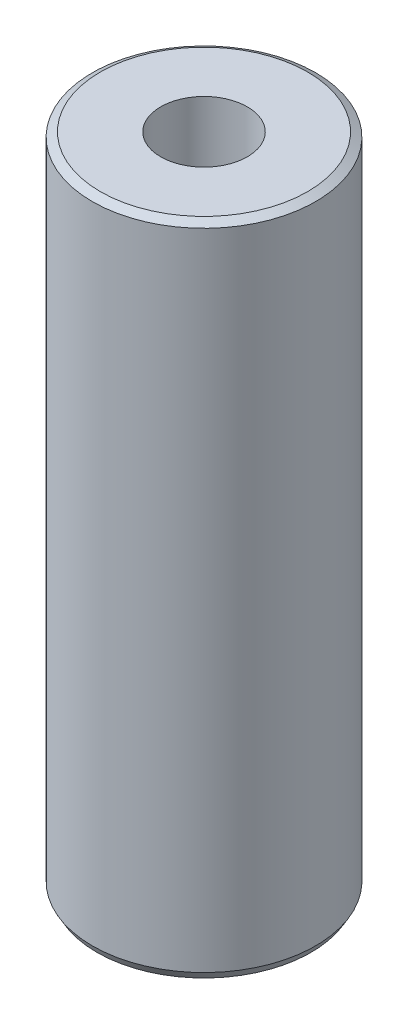
ISO-10303-21;
HEADER;
FILE_DESCRIPTION(('STEP AP214'),'2;1');
FILE_NAME('part.step','',(''),(''),'','','');
FILE_SCHEMA(('AUTOMOTIVE_DESIGN { 1 0 10303 214 1 1 1 1 }'));
ENDSEC;
DATA;
#1=APPLICATION_CONTEXT('core data for automotive mechanical design processes');
#2=APPLICATION_PROTOCOL_DEFINITION('international standard','automotive_design',2000,#1);
#3=PRODUCT_CONTEXT('',#1,'mechanical');
#4=PRODUCT('Part','Part','',(#3));
#5=PRODUCT_RELATED_PRODUCT_CATEGORY('part','',(#4));
#6=PRODUCT_DEFINITION_FORMATION('','',#4);
#7=PRODUCT_DEFINITION_CONTEXT('part definition',#1,'design');
#8=PRODUCT_DEFINITION('design','',#6,#7);
#9=PRODUCT_DEFINITION_SHAPE('','',#8);
#10=(LENGTH_UNIT() NAMED_UNIT(*) SI_UNIT(.MILLI.,.METRE.));
#11=(NAMED_UNIT(*) PLANE_ANGLE_UNIT() SI_UNIT($,.RADIAN.));
#12=(NAMED_UNIT(*) SI_UNIT($,.STERADIAN.) SOLID_ANGLE_UNIT());
#13=UNCERTAINTY_MEASURE_WITH_UNIT(LENGTH_MEASURE(1.E-05),#10,'distance_accuracy_value','');
#14=(GEOMETRIC_REPRESENTATION_CONTEXT(3) GLOBAL_UNCERTAINTY_ASSIGNED_CONTEXT((#13)) GLOBAL_UNIT_ASSIGNED_CONTEXT((#10,
#11,#12)) REPRESENTATION_CONTEXT('',''));
#15=CARTESIAN_POINT('',(0.,0.,0.));
#16=DIRECTION('',(0.,0.,1.));
#17=DIRECTION('',(1.,0.,0.));
#18=AXIS2_PLACEMENT_3D('',#15,#16,#17);
#19=CARTESIAN_POINT('',(0.,29.4262883184921,0.));
#20=DIRECTION('',(0.,-1.,0.));
#21=DIRECTION('',(0.,0.,-1.));
#22=AXIS2_PLACEMENT_3D('',#19,#20,#21);
#23=CYLINDRICAL_SURFACE('',#22,5.);
#24=CARTESIAN_POINT('',(0.,29.2190942660415,0.));
#25=DIRECTION('',(0.,1.,0.));
#26=DIRECTION('',(0.,0.,1.));
#27=AXIS2_PLACEMENT_3D('',#24,#25,#26);
#28=CIRCLE('',#27,5.);
#29=CARTESIAN_POINT('',(0.,29.2190942660415,-5.));
#30=VERTEX_POINT('',#29);
#31=EDGE_CURVE('E50',#30,#30,#28,.F.);
#32=ORIENTED_EDGE('',*,*,#31,.T.);
#33=EDGE_LOOP('',(#32));
#34=FACE_BOUND('',#33,.T.);
#35=CARTESIAN_POINT('',(0.,0.358870625870481,0.));
#36=DIRECTION('',(0.,1.,0.));
#37=DIRECTION('',(0.,0.,1.));
#38=AXIS2_PLACEMENT_3D('',#35,#36,#37);
#39=CIRCLE('',#38,5.);
#40=CARTESIAN_POINT('',(0.,0.358870625870481,5.));
#41=VERTEX_POINT('',#40);
#42=EDGE_CURVE('E51',#41,#41,#39,.T.);
#43=ORIENTED_EDGE('',*,*,#42,.T.);
#44=EDGE_LOOP('',(#43));
#45=FACE_BOUND('',#44,.T.);
#46=ADVANCED_FACE('F39',(#34,#45),#23,.T.);
#47=CARTESIAN_POINT('',(0.,29.4262883184921,0.));
#48=DIRECTION('',(0.,1.,0.));
#49=DIRECTION('',(0.,0.,1.));
#50=AXIS2_PLACEMENT_3D('',#47,#48,#49);
#51=PLANE('',#50);
#52=CARTESIAN_POINT('',(0.,29.4262883184921,0.));
#53=DIRECTION('',(0.,1.,0.));
#54=DIRECTION('',(0.,0.,1.));
#55=AXIS2_PLACEMENT_3D('',#52,#53,#54);
#56=CIRCLE('',#55,4.6411293741295);
#57=CARTESIAN_POINT('',(0.,29.4262883184921,-4.6411293741295));
#58=VERTEX_POINT('',#57);
#59=EDGE_CURVE('E54',#58,#58,#56,.T.);
#60=ORIENTED_EDGE('',*,*,#59,.T.);
#61=EDGE_LOOP('',(#60));
#62=FACE_BOUND('',#61,.T.);
#63=CARTESIAN_POINT('',(0.,29.4262883184921,0.));
#64=DIRECTION('',(0.,1.,0.));
#65=DIRECTION('',(0.,0.,1.));
#66=AXIS2_PLACEMENT_3D('',#63,#64,#65);
#67=CIRCLE('',#66,1.9403768624408);
#68=CARTESIAN_POINT('',(0.,29.4262883184921,1.9403768624408));
#69=VERTEX_POINT('',#68);
#70=EDGE_CURVE('E58',#69,#69,#67,.T.);
#71=ORIENTED_EDGE('',*,*,#70,.F.);
#72=EDGE_LOOP('',(#71));
#73=FACE_BOUND('',#72,.T.);
#74=ADVANCED_FACE('F69',(#62,#73),#51,.T.);
#75=CARTESIAN_POINT('',(0.,0.,0.));
#76=DIRECTION('',(0.,1.,0.));
#77=DIRECTION('',(0.,0.,1.));
#78=AXIS2_PLACEMENT_3D('',#75,#76,#77);
#79=PLANE('',#78);
#80=CARTESIAN_POINT('',(0.,0.,0.));
#81=DIRECTION('',(0.,1.,0.));
#82=DIRECTION('',(0.,0.,1.));
#83=AXIS2_PLACEMENT_3D('',#80,#81,#82);
#84=CIRCLE('',#83,4.79280594754943);
#85=CARTESIAN_POINT('',(0.,0.,4.79280594754943));
#86=VERTEX_POINT('',#85);
#87=EDGE_CURVE('E10',#86,#86,#84,.F.);
#88=ORIENTED_EDGE('',*,*,#87,.T.);
#89=EDGE_LOOP('',(#88));
#90=FACE_BOUND('',#89,.T.);
#91=CARTESIAN_POINT('',(0.,0.,0.));
#92=DIRECTION('',(0.,1.,0.));
#93=DIRECTION('',(0.,0.,1.));
#94=AXIS2_PLACEMENT_3D('',#91,#92,#93);
#95=CIRCLE('',#94,1.9403768624408);
#96=CARTESIAN_POINT('',(0.,0.,1.9403768624408));
#97=VERTEX_POINT('',#96);
#98=EDGE_CURVE('E63',#97,#97,#95,.T.);
#99=ORIENTED_EDGE('',*,*,#98,.T.);
#100=EDGE_LOOP('',(#99));
#101=FACE_BOUND('',#100,.T.);
#102=ADVANCED_FACE('F75',(#90,#101),#79,.F.);
#103=CARTESIAN_POINT('',(0.,29.4262883184921,0.));
#104=DIRECTION('',(0.,-1.,0.));
#105=DIRECTION('',(0.,0.,-1.));
#106=AXIS2_PLACEMENT_3D('',#103,#104,#105);
#107=CYLINDRICAL_SURFACE('',#106,1.9403768624408);
#108=ORIENTED_EDGE('',*,*,#70,.T.);
#109=EDGE_LOOP('',(#108));
#110=FACE_BOUND('',#109,.T.);
#111=ORIENTED_EDGE('',*,*,#98,.F.);
#112=EDGE_LOOP('',(#111));
#113=FACE_BOUND('',#112,.T.);
#114=ADVANCED_FACE('F70',(#110,#113),#107,.F.);
#115=CARTESIAN_POINT('',(0.,29.4262883184921,0.));
#116=DIRECTION('',(0.,-1.,0.));
#117=DIRECTION('',(0.,0.,-1.));
#118=AXIS2_PLACEMENT_3D('',#115,#116,#117);
#119=CONICAL_SURFACE('',#118,4.6411293741295,1.0471975511966);
#120=CARTESIAN_POINT('',(0.,29.2190942660415,-5.));
#121=CARTESIAN_POINT('',(0.,29.2212525374212,-4.99626176431385));
#122=CARTESIAN_POINT('',(0.,29.2234108088009,-4.9925235286277));
#123=CARTESIAN_POINT('',(0.,29.2277273515603,-4.9850470572554));
#124=CARTESIAN_POINT('',(0.,29.22988562294,-4.98130882156925));
#125=CARTESIAN_POINT('',(0.,29.2342021656994,-4.97383235019695));
#126=CARTESIAN_POINT('',(0.,29.236360437079,-4.97009411451079));
#127=CARTESIAN_POINT('',(0.,29.2406769798384,-4.96261764313849));
#128=CARTESIAN_POINT('',(0.,29.2428352512181,-4.95887940745234));
#129=CARTESIAN_POINT('',(0.,29.2471517939775,-4.95140293608004));
#130=CARTESIAN_POINT('',(0.,29.2493100653572,-4.94766470039389));
#131=CARTESIAN_POINT('',(0.,29.2536266081166,-4.94018822902159));
#132=CARTESIAN_POINT('',(0.,29.2557848794963,-4.93644999333543));
#133=CARTESIAN_POINT('',(0.,29.2601014222557,-4.92897352196313));
#134=CARTESIAN_POINT('',(0.,29.2622596936354,-4.92523528627698));
#135=CARTESIAN_POINT('',(0.,29.2665762363948,-4.91775881490468));
#136=CARTESIAN_POINT('',(0.,29.2687345077745,-4.91402057921853));
#137=CARTESIAN_POINT('',(0.,29.2730510505338,-4.90654410784623));
#138=CARTESIAN_POINT('',(0.,29.2752093219135,-4.90280587216007));
#139=CARTESIAN_POINT('',(0.,29.2795258646729,-4.89532940078777));
#140=CARTESIAN_POINT('',(0.,29.2816841360526,-4.89159116510162));
#141=CARTESIAN_POINT('',(0.,29.286000678812,-4.88411469372932));
#142=CARTESIAN_POINT('',(0.,29.2881589501917,-4.88037645804317));
#143=CARTESIAN_POINT('',(0.,29.2924754929511,-4.87289998667087));
#144=CARTESIAN_POINT('',(0.,29.2946337643308,-4.86916175098471));
#145=CARTESIAN_POINT('',(0.,29.2989503070902,-4.86168527961241));
#146=CARTESIAN_POINT('',(0.,29.3011085784699,-4.85794704392626));
#147=CARTESIAN_POINT('',(0.,29.3054251212292,-4.85047057255396));
#148=CARTESIAN_POINT('',(0.,29.3075833926089,-4.84673233686781));
#149=CARTESIAN_POINT('',(0.,29.3118999353683,-4.83925586549551));
#150=CARTESIAN_POINT('',(0.,29.314058206748,-4.83551762980936));
#151=CARTESIAN_POINT('',(0.,29.3183747495074,-4.82804115843705));
#152=CARTESIAN_POINT('',(0.,29.3205330208871,-4.8243029227509));
#153=CARTESIAN_POINT('',(0.,29.3248495636465,-4.8168264513786));
#154=CARTESIAN_POINT('',(0.,29.3270078350262,-4.81308821569245));
#155=CARTESIAN_POINT('',(0.,29.3313243777856,-4.80561174432015));
#156=CARTESIAN_POINT('',(0.,29.3334826491653,-4.80187350863399));
#157=CARTESIAN_POINT('',(0.,29.3377991919246,-4.79439703726169));
#158=CARTESIAN_POINT('',(0.,29.3399574633043,-4.79065880157554));
#159=CARTESIAN_POINT('',(0.,29.3442740060637,-4.78318233020324));
#160=CARTESIAN_POINT('',(0.,29.3464322774434,-4.77944409451709));
#161=CARTESIAN_POINT('',(0.,29.3507488202028,-4.77196762314479));
#162=CARTESIAN_POINT('',(0.,29.3529070915825,-4.76822938745863));
#163=CARTESIAN_POINT('',(0.,29.3572236343419,-4.76075291608633));
#164=CARTESIAN_POINT('',(0.,29.3593819057216,-4.75701468040018));
#165=CARTESIAN_POINT('',(0.,29.363698448481,-4.74953820902788));
#166=CARTESIAN_POINT('',(0.,29.3658567198607,-4.74579997334173));
#167=CARTESIAN_POINT('',(0.,29.37017326262,-4.73832350196943));
#168=CARTESIAN_POINT('',(0.,29.3723315339997,-4.73458526628328));
#169=CARTESIAN_POINT('',(0.,29.3766480767591,-4.72710879491097));
#170=CARTESIAN_POINT('',(0.,29.3788063481388,-4.72337055922482));
#171=CARTESIAN_POINT('',(0.,29.3831228908982,-4.71589408785252));
#172=CARTESIAN_POINT('',(0.,29.3852811622779,-4.71215585216637));
#173=CARTESIAN_POINT('',(0.,29.3895977050373,-4.70467938079407));
#174=CARTESIAN_POINT('',(0.,29.391755976417,-4.70094114510792));
#175=CARTESIAN_POINT('',(0.,29.3960725191764,-4.69346467373561));
#176=CARTESIAN_POINT('',(0.,29.3982307905561,-4.68972643804946));
#177=CARTESIAN_POINT('',(0.,29.4025473333155,-4.68224996667716));
#178=CARTESIAN_POINT('',(0.,29.4047056046951,-4.67851173099101));
#179=CARTESIAN_POINT('',(0.,29.4090221474545,-4.67103525961871));
#180=CARTESIAN_POINT('',(0.,29.4111804188342,-4.66729702393256));
#181=CARTESIAN_POINT('',(0.,29.4154969615936,-4.65982055256025));
#182=CARTESIAN_POINT('',(0.,29.4176552329733,-4.6560823168741));
#183=CARTESIAN_POINT('',(0.,29.4219717757327,-4.6486058455018));
#184=CARTESIAN_POINT('',(0.,29.4241300471124,-4.64486760981565));
#185=CARTESIAN_POINT('',(0.,29.4262883184921,-4.6411293741295));
#186=B_SPLINE_CURVE_WITH_KNOTS('',3,(#120,#121,#122,#123,#124,#125,#126,#127,#128,#129,#130,
#131,#132,#133,#134,#135,#136,#137,#138,#139,#140,#141,#142,#143,#144,#145,#146,#147,#148,#149,
#150,#151,#152,#153,#154,#155,#156,#157,#158,#159,#160,#161,#162,#163,#164,#165,#166,#167,#168,
#169,#170,#171,#172,#173,#174,#175,#176,#177,#178,#179,#180,#181,#182,#183,#184,#185),
.UNSPECIFIED.,.F.,.F.,(4,2,2,2,2,2,2,2,2,2,2,2,2,2,2,2,2,2,2,2,2,2,2,2,2,2,2,2,2,2,2,2,4),(0.,
0.0129496282781622,0.0258992565563243,0.0388488848344848,0.0517985131126469,0.0647481413908091,
0.0776977696689695,0.0906473979471317,0.103597026225294,0.116546654503454,0.129496282781616,
0.142445911059779,0.155395539337939,0.168345167616101,0.181294795894263,0.194244424172424,
0.207194052450586,0.220143680728748,0.233093309006909,0.246042937285071,0.258992565563233,
0.271942193841393,0.284891822119555,0.297841450397718,0.310791078675878,0.32374070695404,
0.336690335232203,0.349639963510363,0.362589591788525,0.375539220066687,0.388488848344848,
0.40143847662301,0.414388104901172),.UNSPECIFIED.);
#187=EDGE_CURVE('BSEAM81',#30,#58,#186,.T.);
#188=ORIENTED_EDGE('',*,*,#31,.F.);
#189=ORIENTED_EDGE('',*,*,#59,.F.);
#190=ORIENTED_EDGE('',*,*,#187,.T.);
#191=ORIENTED_EDGE('',*,*,#187,.F.);
#192=EDGE_LOOP('',(#188,#190,#189,#191));
#193=FACE_BOUND('',#192,.T.);
#194=ADVANCED_FACE('F81',(#193),#119,.T.);
#195=CARTESIAN_POINT('',(0.,0.358870625870481,0.));
#196=DIRECTION('',(0.,1.,0.));
#197=DIRECTION('',(0.,0.,1.));
#198=AXIS2_PLACEMENT_3D('',#195,#196,#197);
#199=CONICAL_SURFACE('',#198,5.,0.523598775598306);
#200=ORIENTED_EDGE('',*,*,#87,.F.);
#201=EDGE_LOOP('',(#200));
#202=FACE_BOUND('',#201,.T.);
#203=ORIENTED_EDGE('',*,*,#42,.F.);
#204=EDGE_LOOP('',(#203));
#205=FACE_BOUND('',#204,.T.);
#206=ADVANCED_FACE('F45',(#202,#205),#199,.T.);
#207=CLOSED_SHELL('',(#46,#74,#102,#114,#194,#206));
#208=MANIFOLD_SOLID_BREP('B2',#207);
#209=ADVANCED_BREP_SHAPE_REPRESENTATION('',(#18,#208),#14);
#210=SHAPE_DEFINITION_REPRESENTATION(#9,#209);
ENDSEC;
END-ISO-10303-21;
